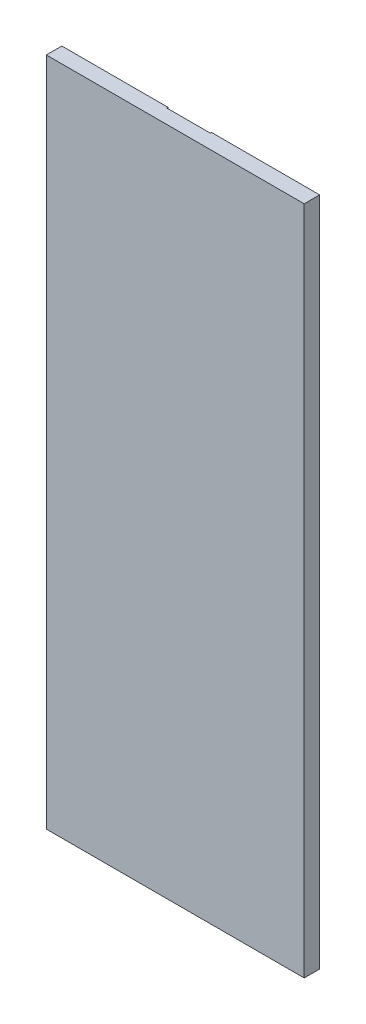
ISO-10303-21;
HEADER;
FILE_DESCRIPTION(('STEP AP214'),'2;1');
FILE_NAME('part.step','',(''),(''),'','','');
FILE_SCHEMA(('AUTOMOTIVE_DESIGN { 1 0 10303 214 1 1 1 1 }'));
ENDSEC;
DATA;
#1=APPLICATION_CONTEXT('core data for automotive mechanical design processes');
#2=APPLICATION_PROTOCOL_DEFINITION('international standard','automotive_design',2000,#1);
#3=PRODUCT_CONTEXT('',#1,'mechanical');
#4=PRODUCT('Part','Part','',(#3));
#5=PRODUCT_RELATED_PRODUCT_CATEGORY('part','',(#4));
#6=PRODUCT_DEFINITION_FORMATION('','',#4);
#7=PRODUCT_DEFINITION_CONTEXT('part definition',#1,'design');
#8=PRODUCT_DEFINITION('design','',#6,#7);
#9=PRODUCT_DEFINITION_SHAPE('','',#8);
#10=(LENGTH_UNIT() NAMED_UNIT(*) SI_UNIT(.MILLI.,.METRE.));
#11=(NAMED_UNIT(*) PLANE_ANGLE_UNIT() SI_UNIT($,.RADIAN.));
#12=(NAMED_UNIT(*) SI_UNIT($,.STERADIAN.) SOLID_ANGLE_UNIT());
#13=UNCERTAINTY_MEASURE_WITH_UNIT(LENGTH_MEASURE(1.E-05),#10,'distance_accuracy_value','');
#14=(GEOMETRIC_REPRESENTATION_CONTEXT(3) GLOBAL_UNCERTAINTY_ASSIGNED_CONTEXT((#13)) GLOBAL_UNIT_ASSIGNED_CONTEXT((#10,
#11,#12)) REPRESENTATION_CONTEXT('',''));
#15=CARTESIAN_POINT('',(0.,0.,0.));
#16=DIRECTION('',(0.,0.,1.));
#17=DIRECTION('',(1.,0.,0.));
#18=AXIS2_PLACEMENT_3D('',#15,#16,#17);
#19=CARTESIAN_POINT('',(0.,650.,0.));
#20=DIRECTION('',(1.,0.,0.));
#21=DIRECTION('',(0.,0.,-1.));
#22=AXIS2_PLACEMENT_3D('',#19,#20,#21);
#23=PLANE('',#22);
#24=DIRECTION('',(0.,0.,1.));
#25=VECTOR('',#24,1.);
#26=CARTESIAN_POINT('',(0.,0.,0.));
#27=LINE('',#26,#25);
#28=CARTESIAN_POINT('',(0.,0.,-15.));
#29=VERTEX_POINT('',#28);
#30=CARTESIAN_POINT('',(0.,0.,0.));
#31=VERTEX_POINT('',#30);
#32=EDGE_CURVE('E154',#29,#31,#27,.T.);
#33=ORIENTED_EDGE('',*,*,#32,.T.);
#34=DIRECTION('',(0.,-1.,0.));
#35=VECTOR('',#34,1.);
#36=CARTESIAN_POINT('',(0.,650.,0.));
#37=LINE('',#36,#35);
#38=CARTESIAN_POINT('',(0.,650.,0.));
#39=VERTEX_POINT('',#38);
#40=EDGE_CURVE('E11',#39,#31,#37,.T.);
#41=ORIENTED_EDGE('',*,*,#40,.F.);
#42=DIRECTION('',(0.,0.,1.));
#43=VECTOR('',#42,1.);
#44=CARTESIAN_POINT('',(0.,650.,0.));
#45=LINE('',#44,#43);
#46=CARTESIAN_POINT('',(0.,650.,-15.));
#47=VERTEX_POINT('',#46);
#48=EDGE_CURVE('E160',#47,#39,#45,.T.);
#49=ORIENTED_EDGE('',*,*,#48,.F.);
#50=DIRECTION('',(0.,-1.,0.));
#51=VECTOR('',#50,1.);
#52=CARTESIAN_POINT('',(0.,650.,-15.));
#53=LINE('',#52,#51);
#54=EDGE_CURVE('E172',#47,#29,#53,.T.);
#55=ORIENTED_EDGE('',*,*,#54,.T.);
#56=EDGE_LOOP('',(#33,#41,#49,#55));
#57=FACE_BOUND('',#56,.T.);
#58=ADVANCED_FACE('F39',(#57),#23,.F.);
#59=CARTESIAN_POINT('',(0.,650.,0.));
#60=DIRECTION('',(0.,0.,-1.));
#61=DIRECTION('',(-1.,0.,0.));
#62=AXIS2_PLACEMENT_3D('',#59,#60,#61);
#63=PLANE('',#62);
#64=DIRECTION('',(1.,0.,0.));
#65=VECTOR('',#64,1.);
#66=CARTESIAN_POINT('',(0.,0.,0.));
#67=LINE('',#66,#65);
#68=CARTESIAN_POINT('',(250.,0.,0.));
#69=VERTEX_POINT('',#68);
#70=EDGE_CURVE('E176',#31,#69,#67,.T.);
#71=ORIENTED_EDGE('',*,*,#70,.T.);
#72=DIRECTION('',(0.,-1.,0.));
#73=VECTOR('',#72,1.);
#74=CARTESIAN_POINT('',(250.,650.,0.));
#75=LINE('',#74,#73);
#76=CARTESIAN_POINT('',(250.,650.,0.));
#77=VERTEX_POINT('',#76);
#78=EDGE_CURVE('E47',#77,#69,#75,.T.);
#79=ORIENTED_EDGE('',*,*,#78,.F.);
#80=DIRECTION('',(1.,0.,0.));
#81=VECTOR('',#80,1.);
#82=CARTESIAN_POINT('',(0.,650.,0.));
#83=LINE('',#82,#81);
#84=EDGE_CURVE('E92',#39,#77,#83,.T.);
#85=ORIENTED_EDGE('',*,*,#84,.F.);
#86=ORIENTED_EDGE('',*,*,#40,.T.);
#87=EDGE_LOOP('',(#71,#79,#85,#86));
#88=FACE_BOUND('',#87,.T.);
#89=ADVANCED_FACE('F218',(#88),#63,.F.);
#90=CARTESIAN_POINT('',(250.,650.,0.));
#91=DIRECTION('',(-1.,0.,0.));
#92=DIRECTION('',(0.,0.,1.));
#93=AXIS2_PLACEMENT_3D('',#90,#91,#92);
#94=PLANE('',#93);
#95=DIRECTION('',(0.,0.,-1.));
#96=VECTOR('',#95,1.);
#97=CARTESIAN_POINT('',(250.,0.,0.));
#98=LINE('',#97,#96);
#99=CARTESIAN_POINT('',(250.,0.,-15.));
#100=VERTEX_POINT('',#99);
#101=EDGE_CURVE('E179',#69,#100,#98,.T.);
#102=ORIENTED_EDGE('',*,*,#101,.T.);
#103=DIRECTION('',(0.,-1.,0.));
#104=VECTOR('',#103,1.);
#105=CARTESIAN_POINT('',(250.,650.,-15.));
#106=LINE('',#105,#104);
#107=CARTESIAN_POINT('',(250.,650.,-15.));
#108=VERTEX_POINT('',#107);
#109=EDGE_CURVE('E186',#108,#100,#106,.T.);
#110=ORIENTED_EDGE('',*,*,#109,.F.);
#111=DIRECTION('',(0.,0.,-1.));
#112=VECTOR('',#111,1.);
#113=CARTESIAN_POINT('',(250.,650.,0.));
#114=LINE('',#113,#112);
#115=EDGE_CURVE('E165',#77,#108,#114,.T.);
#116=ORIENTED_EDGE('',*,*,#115,.F.);
#117=ORIENTED_EDGE('',*,*,#78,.T.);
#118=EDGE_LOOP('',(#102,#110,#116,#117));
#119=FACE_BOUND('',#118,.T.);
#120=ADVANCED_FACE('F193',(#119),#94,.F.);
#121=CARTESIAN_POINT('',(0.,650.,-15.));
#122=DIRECTION('',(0.,0.,1.));
#123=DIRECTION('',(1.,0.,0.));
#124=AXIS2_PLACEMENT_3D('',#121,#122,#123);
#125=PLANE('',#124);
#126=DIRECTION('',(-1.,0.,0.));
#127=VECTOR('',#126,1.);
#128=CARTESIAN_POINT('',(145.15,593.,-15.));
#129=LINE('',#128,#127);
#130=CARTESIAN_POINT('',(145.15,593.,-15.));
#131=VERTEX_POINT('',#130);
#132=CARTESIAN_POINT('',(102.85,593.,-15.));
#133=VERTEX_POINT('',#132);
#134=EDGE_CURVE('E140',#131,#133,#129,.T.);
#135=ORIENTED_EDGE('',*,*,#134,.F.);
#136=DIRECTION('',(0.,-1.,0.));
#137=VECTOR('',#136,1.);
#138=CARTESIAN_POINT('',(145.15,650.,-15.));
#139=LINE('',#138,#137);
#140=CARTESIAN_POINT('',(145.15,650.,-15.));
#141=VERTEX_POINT('',#140);
#142=EDGE_CURVE('E121',#141,#131,#139,.T.);
#143=ORIENTED_EDGE('',*,*,#142,.F.);
#144=DIRECTION('',(-1.,0.,0.));
#145=VECTOR('',#144,1.);
#146=CARTESIAN_POINT('',(0.,650.,-15.));
#147=LINE('',#146,#145);
#148=EDGE_CURVE('E168',#108,#141,#147,.T.);
#149=ORIENTED_EDGE('',*,*,#148,.F.);
#150=ORIENTED_EDGE('',*,*,#109,.T.);
#151=DIRECTION('',(-1.,0.,0.));
#152=VECTOR('',#151,1.);
#153=CARTESIAN_POINT('',(0.,0.,-15.));
#154=LINE('',#153,#152);
#155=EDGE_CURVE('E85',#100,#29,#154,.T.);
#156=ORIENTED_EDGE('',*,*,#155,.T.);
#157=ORIENTED_EDGE('',*,*,#54,.F.);
#158=CARTESIAN_POINT('',(102.85,650.,-15.));
#159=VERTEX_POINT('',#158);
#160=EDGE_CURVE('E63',#159,#47,#147,.T.);
#161=ORIENTED_EDGE('',*,*,#160,.F.);
#162=DIRECTION('',(0.,1.,0.));
#163=VECTOR('',#162,1.);
#164=CARTESIAN_POINT('',(102.85,650.,-15.));
#165=LINE('',#164,#163);
#166=EDGE_CURVE('E137',#133,#159,#165,.T.);
#167=ORIENTED_EDGE('',*,*,#166,.F.);
#168=EDGE_LOOP('',(#135,#143,#149,#150,#156,#157,#161,#167));
#169=FACE_BOUND('',#168,.T.);
#170=ADVANCED_FACE('F201',(#169),#125,.F.);
#171=CARTESIAN_POINT('',(0.,650.,0.));
#172=DIRECTION('',(0.,-1.,0.));
#173=DIRECTION('',(0.,0.,-1.));
#174=AXIS2_PLACEMENT_3D('',#171,#172,#173);
#175=PLANE('',#174);
#176=ORIENTED_EDGE('',*,*,#148,.T.);
#177=DIRECTION('',(0.,0.,-1.));
#178=VECTOR('',#177,1.);
#179=CARTESIAN_POINT('',(145.15,650.,-13.85));
#180=LINE('',#179,#178);
#181=CARTESIAN_POINT('',(145.15,650.,-13.85));
#182=VERTEX_POINT('',#181);
#183=EDGE_CURVE('E151',#182,#141,#180,.T.);
#184=ORIENTED_EDGE('',*,*,#183,.F.);
#185=DIRECTION('',(1.,0.,0.));
#186=VECTOR('',#185,1.);
#187=CARTESIAN_POINT('',(145.15,650.,-13.85));
#188=LINE('',#187,#186);
#189=CARTESIAN_POINT('',(102.85,650.,-13.85));
#190=VERTEX_POINT('',#189);
#191=EDGE_CURVE('E127',#190,#182,#188,.T.);
#192=ORIENTED_EDGE('',*,*,#191,.F.);
#193=DIRECTION('',(0.,0.,-1.));
#194=VECTOR('',#193,1.);
#195=CARTESIAN_POINT('',(102.85,650.,-13.85));
#196=LINE('',#195,#194);
#197=EDGE_CURVE('E155',#190,#159,#196,.T.);
#198=ORIENTED_EDGE('',*,*,#197,.T.);
#199=ORIENTED_EDGE('',*,*,#160,.T.);
#200=ORIENTED_EDGE('',*,*,#48,.T.);
#201=ORIENTED_EDGE('',*,*,#84,.T.);
#202=ORIENTED_EDGE('',*,*,#115,.T.);
#203=EDGE_LOOP('',(#176,#184,#192,#198,#199,#200,#201,#202));
#204=FACE_BOUND('',#203,.T.);
#205=ADVANCED_FACE('F206',(#204),#175,.F.);
#206=CARTESIAN_POINT('',(0.,0.,0.));
#207=DIRECTION('',(0.,-1.,0.));
#208=DIRECTION('',(0.,0.,-1.));
#209=AXIS2_PLACEMENT_3D('',#206,#207,#208);
#210=PLANE('',#209);
#211=ORIENTED_EDGE('',*,*,#32,.F.);
#212=ORIENTED_EDGE('',*,*,#155,.F.);
#213=ORIENTED_EDGE('',*,*,#101,.F.);
#214=ORIENTED_EDGE('',*,*,#70,.F.);
#215=EDGE_LOOP('',(#211,#212,#213,#214));
#216=FACE_BOUND('',#215,.T.);
#217=ADVANCED_FACE('F197',(#216),#210,.T.);
#218=CARTESIAN_POINT('',(145.15,650.,-13.85));
#219=DIRECTION('',(1.,0.,0.));
#220=DIRECTION('',(0.,0.,-1.));
#221=AXIS2_PLACEMENT_3D('',#218,#219,#220);
#222=PLANE('',#221);
#223=ORIENTED_EDGE('',*,*,#142,.T.);
#224=DIRECTION('',(0.,0.,-1.));
#225=VECTOR('',#224,1.);
#226=CARTESIAN_POINT('',(145.15,593.,-13.85));
#227=LINE('',#226,#225);
#228=CARTESIAN_POINT('',(145.15,593.,-13.85));
#229=VERTEX_POINT('',#228);
#230=EDGE_CURVE('E115',#229,#131,#227,.T.);
#231=ORIENTED_EDGE('',*,*,#230,.F.);
#232=DIRECTION('',(0.,-1.,0.));
#233=VECTOR('',#232,1.);
#234=CARTESIAN_POINT('',(145.15,650.,-13.85));
#235=LINE('',#234,#233);
#236=EDGE_CURVE('E119',#182,#229,#235,.T.);
#237=ORIENTED_EDGE('',*,*,#236,.F.);
#238=ORIENTED_EDGE('',*,*,#183,.T.);
#239=EDGE_LOOP('',(#223,#231,#237,#238));
#240=FACE_BOUND('',#239,.T.);
#241=ADVANCED_FACE('F117',(#240),#222,.F.);
#242=CARTESIAN_POINT('',(102.85,650.,-13.85));
#243=DIRECTION('',(-1.,0.,0.));
#244=DIRECTION('',(0.,-1.,0.));
#245=AXIS2_PLACEMENT_3D('',#242,#243,#244);
#246=PLANE('',#245);
#247=ORIENTED_EDGE('',*,*,#166,.T.);
#248=ORIENTED_EDGE('',*,*,#197,.F.);
#249=DIRECTION('',(0.,1.,0.));
#250=VECTOR('',#249,1.);
#251=CARTESIAN_POINT('',(102.85,650.,-13.85));
#252=LINE('',#251,#250);
#253=CARTESIAN_POINT('',(102.85,593.,-13.85));
#254=VERTEX_POINT('',#253);
#255=EDGE_CURVE('E54',#254,#190,#252,.T.);
#256=ORIENTED_EDGE('',*,*,#255,.F.);
#257=DIRECTION('',(0.,0.,-1.));
#258=VECTOR('',#257,1.);
#259=CARTESIAN_POINT('',(102.85,593.,-13.85));
#260=LINE('',#259,#258);
#261=EDGE_CURVE('E126',#254,#133,#260,.T.);
#262=ORIENTED_EDGE('',*,*,#261,.T.);
#263=EDGE_LOOP('',(#247,#248,#256,#262));
#264=FACE_BOUND('',#263,.T.);
#265=ADVANCED_FACE('F205',(#264),#246,.F.);
#266=CARTESIAN_POINT('',(145.15,593.,-13.85));
#267=DIRECTION('',(0.,-1.,0.));
#268=DIRECTION('',(0.,0.,-1.));
#269=AXIS2_PLACEMENT_3D('',#266,#267,#268);
#270=PLANE('',#269);
#271=ORIENTED_EDGE('',*,*,#134,.T.);
#272=ORIENTED_EDGE('',*,*,#261,.F.);
#273=DIRECTION('',(-1.,0.,0.));
#274=VECTOR('',#273,1.);
#275=CARTESIAN_POINT('',(145.15,593.,-13.85));
#276=LINE('',#275,#274);
#277=EDGE_CURVE('E129',#229,#254,#276,.T.);
#278=ORIENTED_EDGE('',*,*,#277,.F.);
#279=ORIENTED_EDGE('',*,*,#230,.T.);
#280=EDGE_LOOP('',(#271,#272,#278,#279));
#281=FACE_BOUND('',#280,.T.);
#282=ADVANCED_FACE('F130',(#281),#270,.F.);
#283=CARTESIAN_POINT('',(0.,0.,-13.85));
#284=DIRECTION('',(0.,0.,-1.));
#285=DIRECTION('',(-1.,0.,0.));
#286=AXIS2_PLACEMENT_3D('',#283,#284,#285);
#287=PLANE('',#286);
#288=ORIENTED_EDGE('',*,*,#236,.T.);
#289=ORIENTED_EDGE('',*,*,#277,.T.);
#290=ORIENTED_EDGE('',*,*,#255,.T.);
#291=ORIENTED_EDGE('',*,*,#191,.T.);
#292=EDGE_LOOP('',(#288,#289,#290,#291));
#293=FACE_BOUND('',#292,.T.);
#294=ADVANCED_FACE('F133',(#293),#287,.T.);
#295=CLOSED_SHELL('',(#58,#89,#120,#170,#205,#217,#241,#265,#282,#294));
#296=MANIFOLD_SOLID_BREP('B2',#295);
#297=ADVANCED_BREP_SHAPE_REPRESENTATION('',(#18,#296),#14);
#298=SHAPE_DEFINITION_REPRESENTATION(#9,#297);
ENDSEC;
END-ISO-10303-21;
